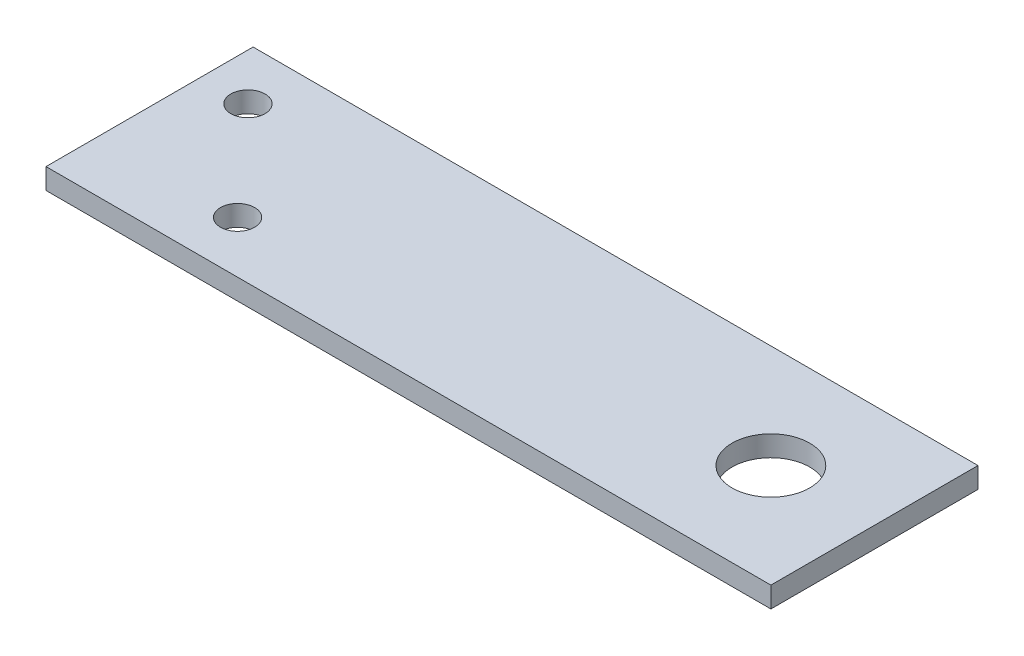
ISO-10303-21;
HEADER;
FILE_DESCRIPTION(('STEP AP214'),'2;1');
FILE_NAME('part.step','',(''),(''),'','','');
FILE_SCHEMA(('AUTOMOTIVE_DESIGN { 1 0 10303 214 1 1 1 1 }'));
ENDSEC;
DATA;
#1=APPLICATION_CONTEXT('core data for automotive mechanical design processes');
#2=APPLICATION_PROTOCOL_DEFINITION('international standard','automotive_design',2000,#1);
#3=PRODUCT_CONTEXT('',#1,'mechanical');
#4=PRODUCT('Part','Part','',(#3));
#5=PRODUCT_RELATED_PRODUCT_CATEGORY('part','',(#4));
#6=PRODUCT_DEFINITION_FORMATION('','',#4);
#7=PRODUCT_DEFINITION_CONTEXT('part definition',#1,'design');
#8=PRODUCT_DEFINITION('design','',#6,#7);
#9=PRODUCT_DEFINITION_SHAPE('','',#8);
#10=(LENGTH_UNIT() NAMED_UNIT(*) SI_UNIT(.MILLI.,.METRE.));
#11=(NAMED_UNIT(*) PLANE_ANGLE_UNIT() SI_UNIT($,.RADIAN.));
#12=(NAMED_UNIT(*) SI_UNIT($,.STERADIAN.) SOLID_ANGLE_UNIT());
#13=UNCERTAINTY_MEASURE_WITH_UNIT(LENGTH_MEASURE(1.E-05),#10,'distance_accuracy_value','');
#14=(GEOMETRIC_REPRESENTATION_CONTEXT(3) GLOBAL_UNCERTAINTY_ASSIGNED_CONTEXT((#13)) GLOBAL_UNIT_ASSIGNED_CONTEXT((#10,
#11,#12)) REPRESENTATION_CONTEXT('',''));
#15=CARTESIAN_POINT('',(0.,0.,0.));
#16=DIRECTION('',(0.,0.,1.));
#17=DIRECTION('',(1.,0.,0.));
#18=AXIS2_PLACEMENT_3D('',#15,#16,#17);
#19=CARTESIAN_POINT('',(88.9,3.175,0.));
#20=DIRECTION('',(-1.,0.,0.));
#21=DIRECTION('',(0.,0.,-1.));
#22=AXIS2_PLACEMENT_3D('',#19,#20,#21);
#23=PLANE('',#22);
#24=DIRECTION('',(0.,1.,0.));
#25=VECTOR('',#24,1.);
#26=CARTESIAN_POINT('',(88.9,3.175,0.));
#27=LINE('',#26,#25);
#28=CARTESIAN_POINT('',(88.9,0.635,0.));
#29=VERTEX_POINT('',#28);
#30=CARTESIAN_POINT('',(88.9,3.175,0.));
#31=VERTEX_POINT('',#30);
#32=EDGE_CURVE('E11',#29,#31,#27,.T.);
#33=ORIENTED_EDGE('',*,*,#32,.F.);
#34=DIRECTION('',(0.,0.,-1.));
#35=VECTOR('',#34,1.);
#36=CARTESIAN_POINT('',(88.9,0.635,0.));
#37=LINE('',#36,#35);
#38=CARTESIAN_POINT('',(88.9,0.635,-25.4));
#39=VERTEX_POINT('',#38);
#40=EDGE_CURVE('E98',#29,#39,#37,.T.);
#41=ORIENTED_EDGE('',*,*,#40,.T.);
#42=DIRECTION('',(0.,1.,0.));
#43=VECTOR('',#42,1.);
#44=CARTESIAN_POINT('',(88.9,3.175,-25.4));
#45=LINE('',#44,#43);
#46=CARTESIAN_POINT('',(88.9,3.175,-25.4));
#47=VERTEX_POINT('',#46);
#48=EDGE_CURVE('E53',#39,#47,#45,.T.);
#49=ORIENTED_EDGE('',*,*,#48,.T.);
#50=DIRECTION('',(0.,0.,-1.));
#51=VECTOR('',#50,1.);
#52=CARTESIAN_POINT('',(88.9,3.175,0.));
#53=LINE('',#52,#51);
#54=EDGE_CURVE('E123',#31,#47,#53,.T.);
#55=ORIENTED_EDGE('',*,*,#54,.F.);
#56=EDGE_LOOP('',(#33,#41,#49,#55));
#57=FACE_BOUND('',#56,.T.);
#58=ADVANCED_FACE('F42',(#57),#23,.F.);
#59=CARTESIAN_POINT('',(0.,3.175,-25.4));
#60=DIRECTION('',(0.,0.,1.));
#61=DIRECTION('',(-1.,0.,0.));
#62=AXIS2_PLACEMENT_3D('',#59,#60,#61);
#63=PLANE('',#62);
#64=ORIENTED_EDGE('',*,*,#48,.F.);
#65=DIRECTION('',(1.,0.,0.));
#66=VECTOR('',#65,1.);
#67=CARTESIAN_POINT('',(0.,0.635,-25.4));
#68=LINE('',#67,#66);
#69=CARTESIAN_POINT('',(0.,0.635,-25.4));
#70=VERTEX_POINT('',#69);
#71=EDGE_CURVE('E112',#39,#70,#68,.F.);
#72=ORIENTED_EDGE('',*,*,#71,.T.);
#73=DIRECTION('',(0.,1.,0.));
#74=VECTOR('',#73,1.);
#75=CARTESIAN_POINT('',(0.,3.175,-25.4));
#76=LINE('',#75,#74);
#77=CARTESIAN_POINT('',(0.,3.175,-25.4));
#78=VERTEX_POINT('',#77);
#79=EDGE_CURVE('E61',#70,#78,#76,.T.);
#80=ORIENTED_EDGE('',*,*,#79,.T.);
#81=DIRECTION('',(-1.,0.,0.));
#82=VECTOR('',#81,1.);
#83=CARTESIAN_POINT('',(0.,3.175,-25.4));
#84=LINE('',#83,#82);
#85=EDGE_CURVE('E92',#47,#78,#84,.T.);
#86=ORIENTED_EDGE('',*,*,#85,.F.);
#87=EDGE_LOOP('',(#64,#72,#80,#86));
#88=FACE_BOUND('',#87,.T.);
#89=ADVANCED_FACE('F129',(#88),#63,.F.);
#90=CARTESIAN_POINT('',(0.,3.175,0.));
#91=DIRECTION('',(1.,0.,0.));
#92=DIRECTION('',(0.,0.,1.));
#93=AXIS2_PLACEMENT_3D('',#90,#91,#92);
#94=PLANE('',#93);
#95=ORIENTED_EDGE('',*,*,#79,.F.);
#96=DIRECTION('',(0.,0.,-1.));
#97=VECTOR('',#96,1.);
#98=CARTESIAN_POINT('',(0.,0.635,0.));
#99=LINE('',#98,#97);
#100=CARTESIAN_POINT('',(0.,0.635,0.));
#101=VERTEX_POINT('',#100);
#102=EDGE_CURVE('E97',#70,#101,#99,.F.);
#103=ORIENTED_EDGE('',*,*,#102,.T.);
#104=DIRECTION('',(0.,1.,0.));
#105=VECTOR('',#104,1.);
#106=CARTESIAN_POINT('',(0.,3.175,0.));
#107=LINE('',#106,#105);
#108=CARTESIAN_POINT('',(0.,3.175,0.));
#109=VERTEX_POINT('',#108);
#110=EDGE_CURVE('E46',#101,#109,#107,.T.);
#111=ORIENTED_EDGE('',*,*,#110,.T.);
#112=DIRECTION('',(0.,0.,1.));
#113=VECTOR('',#112,1.);
#114=CARTESIAN_POINT('',(0.,3.175,0.));
#115=LINE('',#114,#113);
#116=EDGE_CURVE('E291',#78,#109,#115,.T.);
#117=ORIENTED_EDGE('',*,*,#116,.F.);
#118=EDGE_LOOP('',(#95,#103,#111,#117));
#119=FACE_BOUND('',#118,.T.);
#120=ADVANCED_FACE('F101',(#119),#94,.F.);
#121=CARTESIAN_POINT('',(76.2,3.175,-12.7));
#122=DIRECTION('',(0.,-1.,0.));
#123=DIRECTION('',(0.,0.,-1.));
#124=AXIS2_PLACEMENT_3D('',#121,#122,#123);
#125=CYLINDRICAL_SURFACE('',#124,4.7625);
#126=CARTESIAN_POINT('',(76.2,3.175,-12.7));
#127=DIRECTION('',(0.,1.,0.));
#128=DIRECTION('',(0.,0.,1.));
#129=AXIS2_PLACEMENT_3D('',#126,#127,#128);
#130=CIRCLE('',#129,4.7625);
#131=CARTESIAN_POINT('',(76.2,3.175,-7.9375));
#132=VERTEX_POINT('',#131);
#133=EDGE_CURVE('E115',#132,#132,#130,.T.);
#134=ORIENTED_EDGE('',*,*,#133,.T.);
#135=EDGE_LOOP('',(#134));
#136=FACE_BOUND('',#135,.T.);
#137=CARTESIAN_POINT('',(76.2,0.635,-12.7));
#138=DIRECTION('',(0.,1.,0.));
#139=DIRECTION('',(0.,0.,1.));
#140=AXIS2_PLACEMENT_3D('',#137,#138,#139);
#141=CIRCLE('',#140,4.7625);
#142=CARTESIAN_POINT('',(76.2,0.635,-7.9375));
#143=VERTEX_POINT('',#142);
#144=EDGE_CURVE('E135',#143,#143,#141,.T.);
#145=ORIENTED_EDGE('',*,*,#144,.F.);
#146=EDGE_LOOP('',(#145));
#147=FACE_BOUND('',#146,.T.);
#148=ADVANCED_FACE('F148',(#136,#147),#125,.F.);
#149=CARTESIAN_POINT('',(5.715,3.175,-19.05));
#150=DIRECTION('',(0.,-1.,0.));
#151=DIRECTION('',(0.,0.,-1.));
#152=AXIS2_PLACEMENT_3D('',#149,#150,#151);
#153=CYLINDRICAL_SURFACE('',#152,2.0955);
#154=CARTESIAN_POINT('',(5.715,3.175,-19.05));
#155=DIRECTION('',(0.,1.,0.));
#156=DIRECTION('',(0.,0.,1.));
#157=AXIS2_PLACEMENT_3D('',#154,#155,#156);
#158=CIRCLE('',#157,2.0955);
#159=CARTESIAN_POINT('',(5.715,3.175,-16.9545));
#160=VERTEX_POINT('',#159);
#161=EDGE_CURVE('E286',#160,#160,#158,.T.);
#162=ORIENTED_EDGE('',*,*,#161,.T.);
#163=EDGE_LOOP('',(#162));
#164=FACE_BOUND('',#163,.T.);
#165=CARTESIAN_POINT('',(5.715,0.635,-19.05));
#166=DIRECTION('',(0.,1.,0.));
#167=DIRECTION('',(0.,0.,1.));
#168=AXIS2_PLACEMENT_3D('',#165,#166,#167);
#169=CIRCLE('',#168,2.0955);
#170=CARTESIAN_POINT('',(5.715,0.635,-16.9545));
#171=VERTEX_POINT('',#170);
#172=EDGE_CURVE('E108',#171,#171,#169,.T.);
#173=ORIENTED_EDGE('',*,*,#172,.F.);
#174=EDGE_LOOP('',(#173));
#175=FACE_BOUND('',#174,.T.);
#176=ADVANCED_FACE('F145',(#164,#175),#153,.F.);
#177=CARTESIAN_POINT('',(17.145,3.175,-6.35));
#178=DIRECTION('',(0.,-1.,0.));
#179=DIRECTION('',(0.,0.,-1.));
#180=AXIS2_PLACEMENT_3D('',#177,#178,#179);
#181=CYLINDRICAL_SURFACE('',#180,2.0955);
#182=CARTESIAN_POINT('',(17.145,3.175,-6.35));
#183=DIRECTION('',(0.,1.,0.));
#184=DIRECTION('',(0.,0.,1.));
#185=AXIS2_PLACEMENT_3D('',#182,#183,#184);
#186=CIRCLE('',#185,2.0955);
#187=CARTESIAN_POINT('',(17.145,3.175,-4.2545));
#188=VERTEX_POINT('',#187);
#189=EDGE_CURVE('E289',#188,#188,#186,.T.);
#190=ORIENTED_EDGE('',*,*,#189,.T.);
#191=EDGE_LOOP('',(#190));
#192=FACE_BOUND('',#191,.T.);
#193=CARTESIAN_POINT('',(17.145,0.635,-6.35));
#194=DIRECTION('',(0.,1.,0.));
#195=DIRECTION('',(0.,0.,1.));
#196=AXIS2_PLACEMENT_3D('',#193,#194,#195);
#197=CIRCLE('',#196,2.0955);
#198=CARTESIAN_POINT('',(17.145,0.635,-4.2545));
#199=VERTEX_POINT('',#198);
#200=EDGE_CURVE('E103',#199,#199,#197,.T.);
#201=ORIENTED_EDGE('',*,*,#200,.F.);
#202=EDGE_LOOP('',(#201));
#203=FACE_BOUND('',#202,.T.);
#204=ADVANCED_FACE('F147',(#192,#203),#181,.F.);
#205=CARTESIAN_POINT('',(0.,3.175,0.));
#206=DIRECTION('',(0.,0.,-1.));
#207=DIRECTION('',(1.,0.,0.));
#208=AXIS2_PLACEMENT_3D('',#205,#206,#207);
#209=PLANE('',#208);
#210=DIRECTION('',(1.,0.,0.));
#211=VECTOR('',#210,1.);
#212=CARTESIAN_POINT('',(0.,0.635,0.));
#213=LINE('',#212,#211);
#214=EDGE_CURVE('E85',#101,#29,#213,.T.);
#215=ORIENTED_EDGE('',*,*,#214,.T.);
#216=ORIENTED_EDGE('',*,*,#32,.T.);
#217=DIRECTION('',(1.,0.,0.));
#218=VECTOR('',#217,1.);
#219=CARTESIAN_POINT('',(0.,3.175,0.));
#220=LINE('',#219,#218);
#221=EDGE_CURVE('E87',#109,#31,#220,.T.);
#222=ORIENTED_EDGE('',*,*,#221,.F.);
#223=ORIENTED_EDGE('',*,*,#110,.F.);
#224=EDGE_LOOP('',(#215,#216,#222,#223));
#225=FACE_BOUND('',#224,.T.);
#226=ADVANCED_FACE('F44',(#225),#209,.F.);
#227=CARTESIAN_POINT('',(0.,3.175,0.));
#228=DIRECTION('',(0.,-1.,0.));
#229=DIRECTION('',(0.,0.,-1.));
#230=AXIS2_PLACEMENT_3D('',#227,#228,#229);
#231=PLANE('',#230);
#232=ORIENTED_EDGE('',*,*,#133,.F.);
#233=EDGE_LOOP('',(#232));
#234=FACE_BOUND('',#233,.T.);
#235=ORIENTED_EDGE('',*,*,#161,.F.);
#236=EDGE_LOOP('',(#235));
#237=FACE_BOUND('',#236,.T.);
#238=ORIENTED_EDGE('',*,*,#189,.F.);
#239=EDGE_LOOP('',(#238));
#240=FACE_BOUND('',#239,.T.);
#241=ORIENTED_EDGE('',*,*,#116,.T.);
#242=ORIENTED_EDGE('',*,*,#221,.T.);
#243=ORIENTED_EDGE('',*,*,#54,.T.);
#244=ORIENTED_EDGE('',*,*,#85,.T.);
#245=EDGE_LOOP('',(#241,#242,#243,#244));
#246=FACE_BOUND('',#245,.T.);
#247=ADVANCED_FACE('F126',(#234,#237,#240,#246),#231,.F.);
#248=CARTESIAN_POINT('',(0.,0.635,0.));
#249=DIRECTION('',(0.,-1.,0.));
#250=DIRECTION('',(0.,0.,-1.));
#251=AXIS2_PLACEMENT_3D('',#248,#249,#250);
#252=PLANE('',#251);
#253=ORIENTED_EDGE('',*,*,#144,.T.);
#254=EDGE_LOOP('',(#253));
#255=FACE_BOUND('',#254,.T.);
#256=ORIENTED_EDGE('',*,*,#172,.T.);
#257=EDGE_LOOP('',(#256));
#258=FACE_BOUND('',#257,.T.);
#259=ORIENTED_EDGE('',*,*,#200,.T.);
#260=EDGE_LOOP('',(#259));
#261=FACE_BOUND('',#260,.T.);
#262=ORIENTED_EDGE('',*,*,#102,.F.);
#263=ORIENTED_EDGE('',*,*,#71,.F.);
#264=ORIENTED_EDGE('',*,*,#40,.F.);
#265=ORIENTED_EDGE('',*,*,#214,.F.);
#266=EDGE_LOOP('',(#262,#263,#264,#265));
#267=FACE_BOUND('',#266,.T.);
#268=ADVANCED_FACE('F95',(#255,#258,#261,#267),#252,.T.);
#269=CLOSED_SHELL('',(#58,#89,#120,#148,#176,#204,#226,#247,#268));
#270=MANIFOLD_SOLID_BREP('B2',#269);
#271=ADVANCED_BREP_SHAPE_REPRESENTATION('',(#18,#270),#14);
#272=SHAPE_DEFINITION_REPRESENTATION(#9,#271);
ENDSEC;
END-ISO-10303-21;
